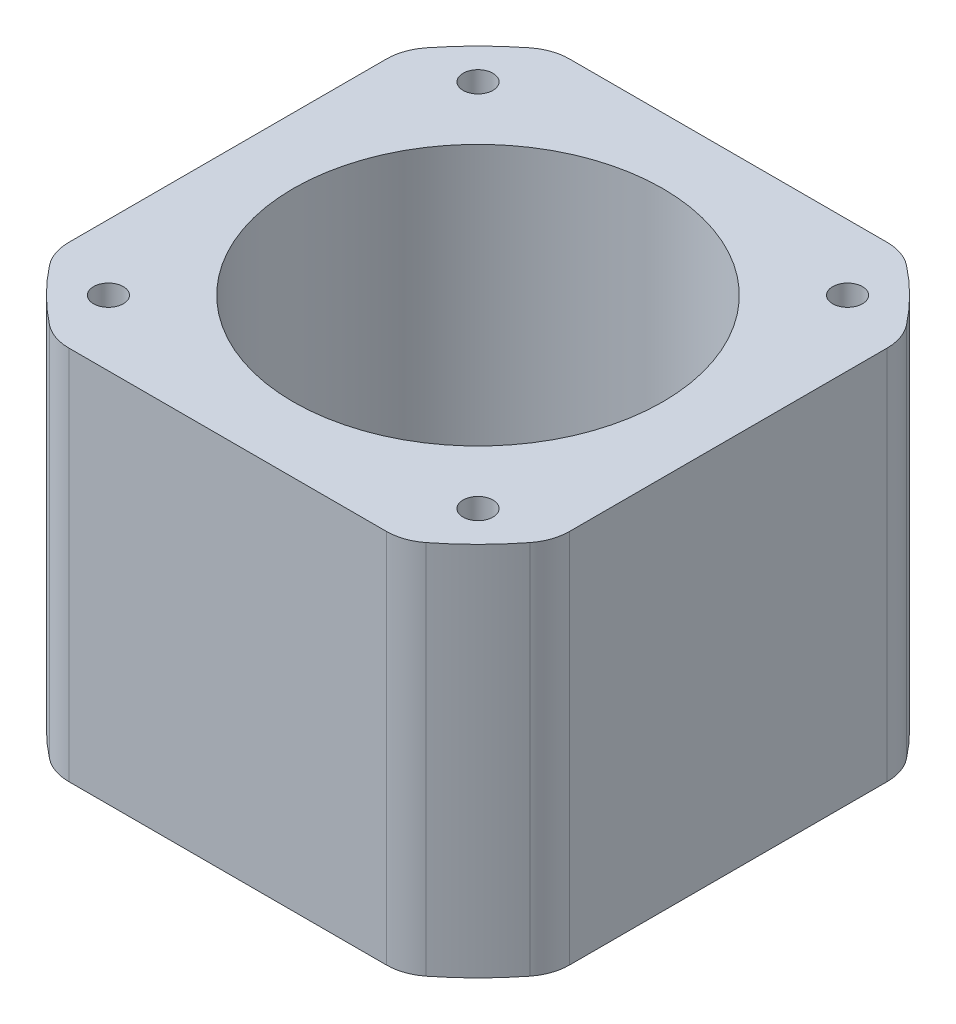
ISO-10303-21;
HEADER;
FILE_DESCRIPTION(('STEP AP214'),'2;1');
FILE_NAME('part.step','',(''),(''),'','','');
FILE_SCHEMA(('AUTOMOTIVE_DESIGN { 1 0 10303 214 1 1 1 1 }'));
ENDSEC;
DATA;
#1=APPLICATION_CONTEXT('core data for automotive mechanical design processes');
#2=APPLICATION_PROTOCOL_DEFINITION('international standard','automotive_design',2000,#1);
#3=PRODUCT_CONTEXT('',#1,'mechanical');
#4=PRODUCT('Part','Part','',(#3));
#5=PRODUCT_RELATED_PRODUCT_CATEGORY('part','',(#4));
#6=PRODUCT_DEFINITION_FORMATION('','',#4);
#7=PRODUCT_DEFINITION_CONTEXT('part definition',#1,'design');
#8=PRODUCT_DEFINITION('design','',#6,#7);
#9=PRODUCT_DEFINITION_SHAPE('','',#8);
#10=(LENGTH_UNIT() NAMED_UNIT(*) SI_UNIT(.MILLI.,.METRE.));
#11=(NAMED_UNIT(*) PLANE_ANGLE_UNIT() SI_UNIT($,.RADIAN.));
#12=(NAMED_UNIT(*) SI_UNIT($,.STERADIAN.) SOLID_ANGLE_UNIT());
#13=UNCERTAINTY_MEASURE_WITH_UNIT(LENGTH_MEASURE(1.E-05),#10,'distance_accuracy_value','');
#14=(GEOMETRIC_REPRESENTATION_CONTEXT(3) GLOBAL_UNCERTAINTY_ASSIGNED_CONTEXT((#13)) GLOBAL_UNIT_ASSIGNED_CONTEXT((#10,
#11,#12)) REPRESENTATION_CONTEXT('',''));
#15=CARTESIAN_POINT('',(0.,0.,0.));
#16=DIRECTION('',(0.,0.,1.));
#17=DIRECTION('',(1.,0.,0.));
#18=AXIS2_PLACEMENT_3D('',#15,#16,#17);
#19=CARTESIAN_POINT('',(15.5,31.5,15.5));
#20=DIRECTION('',(0.,-1.,0.));
#21=DIRECTION('',(0.,0.,-1.));
#22=AXIS2_PLACEMENT_3D('',#19,#20,#21);
#23=CYLINDRICAL_SURFACE('',#22,1.25000000000001);
#24=CARTESIAN_POINT('',(15.5,31.5,15.5));
#25=DIRECTION('',(0.,-1.,0.));
#26=DIRECTION('',(0.,0.,-1.));
#27=AXIS2_PLACEMENT_3D('',#24,#25,#26);
#28=CIRCLE('',#27,1.25000000000001);
#29=CARTESIAN_POINT('',(15.5,31.5,14.25));
#30=VERTEX_POINT('',#29);
#31=EDGE_CURVE('E197',#30,#30,#28,.T.);
#32=ORIENTED_EDGE('',*,*,#31,.F.);
#33=EDGE_LOOP('',(#32));
#34=FACE_BOUND('',#33,.T.);
#35=CARTESIAN_POINT('',(15.5,0.,15.5));
#36=DIRECTION('',(0.,-1.,0.));
#37=DIRECTION('',(0.,0.,-1.));
#38=AXIS2_PLACEMENT_3D('',#35,#36,#37);
#39=CIRCLE('',#38,1.25000000000001);
#40=CARTESIAN_POINT('',(15.5,0.,14.25));
#41=VERTEX_POINT('',#40);
#42=EDGE_CURVE('E19',#41,#41,#39,.T.);
#43=ORIENTED_EDGE('',*,*,#42,.T.);
#44=EDGE_LOOP('',(#43));
#45=FACE_BOUND('',#44,.T.);
#46=ADVANCED_FACE('F16',(#34,#45),#23,.F.);
#47=CARTESIAN_POINT('',(-15.5,31.5,-15.5));
#48=DIRECTION('',(0.,-1.,0.));
#49=DIRECTION('',(0.,0.,-1.));
#50=AXIS2_PLACEMENT_3D('',#47,#48,#49);
#51=CYLINDRICAL_SURFACE('',#50,1.25000000000001);
#52=CARTESIAN_POINT('',(-15.5,31.5,-15.5));
#53=DIRECTION('',(0.,-1.,0.));
#54=DIRECTION('',(0.,0.,-1.));
#55=AXIS2_PLACEMENT_3D('',#52,#53,#54);
#56=CIRCLE('',#55,1.25000000000001);
#57=CARTESIAN_POINT('',(-15.5,31.5,-16.75));
#58=VERTEX_POINT('',#57);
#59=EDGE_CURVE('E200',#58,#58,#56,.T.);
#60=ORIENTED_EDGE('',*,*,#59,.F.);
#61=EDGE_LOOP('',(#60));
#62=FACE_BOUND('',#61,.T.);
#63=CARTESIAN_POINT('',(-15.5,0.,-15.5));
#64=DIRECTION('',(0.,-1.,0.));
#65=DIRECTION('',(0.,0.,-1.));
#66=AXIS2_PLACEMENT_3D('',#63,#64,#65);
#67=CIRCLE('',#66,1.25000000000001);
#68=CARTESIAN_POINT('',(-15.5,0.,-16.75));
#69=VERTEX_POINT('',#68);
#70=EDGE_CURVE('E155',#69,#69,#67,.T.);
#71=ORIENTED_EDGE('',*,*,#70,.T.);
#72=EDGE_LOOP('',(#71));
#73=FACE_BOUND('',#72,.T.);
#74=ADVANCED_FACE('F519',(#62,#73),#51,.F.);
#75=CARTESIAN_POINT('',(0.,31.5,0.));
#76=DIRECTION('',(0.,-1.,0.));
#77=DIRECTION('',(0.,0.,-1.));
#78=AXIS2_PLACEMENT_3D('',#75,#76,#77);
#79=CYLINDRICAL_SURFACE('',#78,25.6);
#80=CARTESIAN_POINT('',(0.,31.5,0.));
#81=DIRECTION('',(0.,-1.,0.));
#82=DIRECTION('',(0.,0.,-1.));
#83=AXIS2_PLACEMENT_3D('',#80,#81,#82);
#84=CIRCLE('',#83,25.6);
#85=CARTESIAN_POINT('',(-15.7927871574424,31.5,-20.1481481481482));
#86=VERTEX_POINT('',#85);
#87=CARTESIAN_POINT('',(-20.1481481481482,31.5,-15.7927871574423));
#88=VERTEX_POINT('',#87);
#89=EDGE_CURVE('E203',#86,#88,#84,.F.);
#90=ORIENTED_EDGE('',*,*,#89,.F.);
#91=DIRECTION('',(0.,-1.,0.));
#92=VECTOR('',#91,1.);
#93=CARTESIAN_POINT('',(-15.7927871574424,31.5,-20.1481481481482));
#94=LINE('',#93,#92);
#95=CARTESIAN_POINT('',(-15.7927871574424,0.,-20.1481481481482));
#96=VERTEX_POINT('',#95);
#97=EDGE_CURVE('E267',#96,#86,#94,.F.);
#98=ORIENTED_EDGE('',*,*,#97,.F.);
#99=CARTESIAN_POINT('',(0.,0.,0.));
#100=DIRECTION('',(0.,-1.,0.));
#101=DIRECTION('',(0.,0.,-1.));
#102=AXIS2_PLACEMENT_3D('',#99,#100,#101);
#103=CIRCLE('',#102,25.6);
#104=CARTESIAN_POINT('',(-20.1481481481482,0.,-15.7927871574423));
#105=VERTEX_POINT('',#104);
#106=EDGE_CURVE('E184',#96,#105,#103,.F.);
#107=ORIENTED_EDGE('',*,*,#106,.T.);
#108=DIRECTION('',(0.,-1.,0.));
#109=VECTOR('',#108,1.);
#110=CARTESIAN_POINT('',(-20.1481481481482,31.5,-15.7927871574423));
#111=LINE('',#110,#109);
#112=EDGE_CURVE('E237',#88,#105,#111,.T.);
#113=ORIENTED_EDGE('',*,*,#112,.F.);
#114=EDGE_LOOP('',(#90,#98,#107,#113));
#115=FACE_BOUND('',#114,.T.);
#116=ADVANCED_FACE('F311',(#115),#79,.T.);
#117=CARTESIAN_POINT('',(-17.,31.5,-13.325164164092));
#118=DIRECTION('',(0.,-1.,0.));
#119=DIRECTION('',(0.,0.,-1.));
#120=AXIS2_PLACEMENT_3D('',#117,#118,#119);
#121=CYLINDRICAL_SURFACE('',#120,4.);
#122=CARTESIAN_POINT('',(-17.,0.,-13.325164164092));
#123=DIRECTION('',(0.,-1.,0.));
#124=DIRECTION('',(0.,0.,-1.));
#125=AXIS2_PLACEMENT_3D('',#122,#123,#124);
#126=CIRCLE('',#125,4.);
#127=CARTESIAN_POINT('',(-21.,0.,-13.325164164092));
#128=VERTEX_POINT('',#127);
#129=EDGE_CURVE('E187',#105,#128,#126,.F.);
#130=ORIENTED_EDGE('',*,*,#129,.T.);
#131=DIRECTION('',(0.,1.,0.));
#132=VECTOR('',#131,1.);
#133=CARTESIAN_POINT('',(-21.,31.5,-13.325164164092));
#134=LINE('',#133,#132);
#135=CARTESIAN_POINT('',(-21.,31.5,-13.325164164092));
#136=VERTEX_POINT('',#135);
#137=EDGE_CURVE('E239',#128,#136,#134,.T.);
#138=ORIENTED_EDGE('',*,*,#137,.T.);
#139=CARTESIAN_POINT('',(-17.,31.5,-13.325164164092));
#140=DIRECTION('',(0.,-1.,0.));
#141=DIRECTION('',(0.,0.,-1.));
#142=AXIS2_PLACEMENT_3D('',#139,#140,#141);
#143=CIRCLE('',#142,4.);
#144=EDGE_CURVE('E205',#88,#136,#143,.F.);
#145=ORIENTED_EDGE('',*,*,#144,.F.);
#146=ORIENTED_EDGE('',*,*,#112,.T.);
#147=EDGE_LOOP('',(#130,#138,#145,#146));
#148=FACE_BOUND('',#147,.T.);
#149=ADVANCED_FACE('F315',(#148),#121,.T.);
#150=CARTESIAN_POINT('',(-21.,31.5,14.641038214553));
#151=DIRECTION('',(1.,0.,0.));
#152=DIRECTION('',(0.,0.,-1.));
#153=AXIS2_PLACEMENT_3D('',#150,#151,#152);
#154=PLANE('',#153);
#155=ORIENTED_EDGE('',*,*,#137,.F.);
#156=DIRECTION('',(0.,0.,1.));
#157=VECTOR('',#156,1.);
#158=CARTESIAN_POINT('',(-21.,0.,0.));
#159=LINE('',#158,#157);
#160=CARTESIAN_POINT('',(-21.,0.,13.325164164092));
#161=VERTEX_POINT('',#160);
#162=EDGE_CURVE('E190',#128,#161,#159,.T.);
#163=ORIENTED_EDGE('',*,*,#162,.T.);
#164=DIRECTION('',(0.,-1.,0.));
#165=VECTOR('',#164,1.);
#166=CARTESIAN_POINT('',(-21.,31.5,13.325164164092));
#167=LINE('',#166,#165);
#168=CARTESIAN_POINT('',(-21.,31.5,13.325164164092));
#169=VERTEX_POINT('',#168);
#170=EDGE_CURVE('E127',#169,#161,#167,.T.);
#171=ORIENTED_EDGE('',*,*,#170,.F.);
#172=DIRECTION('',(0.,0.,1.));
#173=VECTOR('',#172,1.);
#174=CARTESIAN_POINT('',(-21.,31.5,0.));
#175=LINE('',#174,#173);
#176=EDGE_CURVE('E207',#136,#169,#175,.T.);
#177=ORIENTED_EDGE('',*,*,#176,.F.);
#178=EDGE_LOOP('',(#155,#163,#171,#177));
#179=FACE_BOUND('',#178,.T.);
#180=ADVANCED_FACE('F318',(#179),#154,.F.);
#181=CARTESIAN_POINT('',(-17.,31.5,13.325164164092));
#182=DIRECTION('',(0.,-1.,0.));
#183=DIRECTION('',(0.,0.,-1.));
#184=AXIS2_PLACEMENT_3D('',#181,#182,#183);
#185=CYLINDRICAL_SURFACE('',#184,4.);
#186=CARTESIAN_POINT('',(-17.,0.,13.325164164092));
#187=DIRECTION('',(0.,-1.,0.));
#188=DIRECTION('',(0.,0.,-1.));
#189=AXIS2_PLACEMENT_3D('',#186,#187,#188);
#190=CIRCLE('',#189,4.);
#191=CARTESIAN_POINT('',(-20.1481481481482,0.,15.7927871574423));
#192=VERTEX_POINT('',#191);
#193=EDGE_CURVE('E148',#161,#192,#190,.F.);
#194=ORIENTED_EDGE('',*,*,#193,.T.);
#195=DIRECTION('',(0.,-1.,0.));
#196=VECTOR('',#195,1.);
#197=CARTESIAN_POINT('',(-20.1481481481482,31.5,15.7927871574423));
#198=LINE('',#197,#196);
#199=CARTESIAN_POINT('',(-20.1481481481482,31.5,15.7927871574423));
#200=VERTEX_POINT('',#199);
#201=EDGE_CURVE('E134',#200,#192,#198,.T.);
#202=ORIENTED_EDGE('',*,*,#201,.F.);
#203=CARTESIAN_POINT('',(-17.,31.5,13.325164164092));
#204=DIRECTION('',(0.,-1.,0.));
#205=DIRECTION('',(0.,0.,-1.));
#206=AXIS2_PLACEMENT_3D('',#203,#204,#205);
#207=CIRCLE('',#206,4.);
#208=EDGE_CURVE('E208',#169,#200,#207,.F.);
#209=ORIENTED_EDGE('',*,*,#208,.F.);
#210=ORIENTED_EDGE('',*,*,#170,.T.);
#211=EDGE_LOOP('',(#194,#202,#209,#210));
#212=FACE_BOUND('',#211,.T.);
#213=ADVANCED_FACE('F154',(#212),#185,.T.);
#214=CARTESIAN_POINT('',(0.,31.5,0.));
#215=DIRECTION('',(0.,-1.,0.));
#216=DIRECTION('',(0.,0.,-1.));
#217=AXIS2_PLACEMENT_3D('',#214,#215,#216);
#218=CYLINDRICAL_SURFACE('',#217,25.6);
#219=CARTESIAN_POINT('',(0.,31.5,0.));
#220=DIRECTION('',(0.,-1.,0.));
#221=DIRECTION('',(0.,0.,-1.));
#222=AXIS2_PLACEMENT_3D('',#219,#220,#221);
#223=CIRCLE('',#222,25.6);
#224=CARTESIAN_POINT('',(-15.7927871574423,31.5,20.1481481481482));
#225=VERTEX_POINT('',#224);
#226=EDGE_CURVE('E139',#200,#225,#223,.F.);
#227=ORIENTED_EDGE('',*,*,#226,.F.);
#228=ORIENTED_EDGE('',*,*,#201,.T.);
#229=CARTESIAN_POINT('',(0.,0.,0.));
#230=DIRECTION('',(0.,-1.,0.));
#231=DIRECTION('',(0.,0.,-1.));
#232=AXIS2_PLACEMENT_3D('',#229,#230,#231);
#233=CIRCLE('',#232,25.6);
#234=CARTESIAN_POINT('',(-15.7927871574423,0.,20.1481481481482));
#235=VERTEX_POINT('',#234);
#236=EDGE_CURVE('E138',#192,#235,#233,.F.);
#237=ORIENTED_EDGE('',*,*,#236,.T.);
#238=DIRECTION('',(0.,-1.,0.));
#239=VECTOR('',#238,1.);
#240=CARTESIAN_POINT('',(-15.7927871574423,31.5,20.1481481481482));
#241=LINE('',#240,#239);
#242=EDGE_CURVE('E140',#225,#235,#241,.T.);
#243=ORIENTED_EDGE('',*,*,#242,.F.);
#244=EDGE_LOOP('',(#227,#228,#237,#243));
#245=FACE_BOUND('',#244,.T.);
#246=ADVANCED_FACE('F136',(#245),#218,.T.);
#247=CARTESIAN_POINT('',(-13.325164164092,31.5,17.));
#248=DIRECTION('',(0.,-1.,0.));
#249=DIRECTION('',(0.,0.,-1.));
#250=AXIS2_PLACEMENT_3D('',#247,#248,#249);
#251=CYLINDRICAL_SURFACE('',#250,4.);
#252=CARTESIAN_POINT('',(-13.325164164092,0.,17.));
#253=DIRECTION('',(0.,-1.,0.));
#254=DIRECTION('',(0.,0.,-1.));
#255=AXIS2_PLACEMENT_3D('',#252,#253,#254);
#256=CIRCLE('',#255,4.);
#257=CARTESIAN_POINT('',(-13.325164164092,0.,21.));
#258=VERTEX_POINT('',#257);
#259=EDGE_CURVE('E152',#235,#258,#256,.F.);
#260=ORIENTED_EDGE('',*,*,#259,.T.);
#261=DIRECTION('',(0.,1.,0.));
#262=VECTOR('',#261,1.);
#263=CARTESIAN_POINT('',(-13.325164164092,31.5,21.));
#264=LINE('',#263,#262);
#265=CARTESIAN_POINT('',(-13.325164164092,31.5,21.));
#266=VERTEX_POINT('',#265);
#267=EDGE_CURVE('E244',#258,#266,#264,.T.);
#268=ORIENTED_EDGE('',*,*,#267,.T.);
#269=CARTESIAN_POINT('',(-13.325164164092,31.5,17.));
#270=DIRECTION('',(0.,-1.,0.));
#271=DIRECTION('',(0.,0.,-1.));
#272=AXIS2_PLACEMENT_3D('',#269,#270,#271);
#273=CIRCLE('',#272,4.);
#274=EDGE_CURVE('E211',#225,#266,#273,.F.);
#275=ORIENTED_EDGE('',*,*,#274,.F.);
#276=ORIENTED_EDGE('',*,*,#242,.T.);
#277=EDGE_LOOP('',(#260,#268,#275,#276));
#278=FACE_BOUND('',#277,.T.);
#279=ADVANCED_FACE('F337',(#278),#251,.T.);
#280=CARTESIAN_POINT('',(-14.641038214553,31.5,21.));
#281=DIRECTION('',(0.,0.,-1.));
#282=DIRECTION('',(-1.,0.,0.));
#283=AXIS2_PLACEMENT_3D('',#280,#281,#282);
#284=PLANE('',#283);
#285=DIRECTION('',(0.,-1.,0.));
#286=VECTOR('',#285,1.);
#287=CARTESIAN_POINT('',(13.3251641640919,31.5,21.));
#288=LINE('',#287,#286);
#289=CARTESIAN_POINT('',(13.3251641640919,31.5,21.));
#290=VERTEX_POINT('',#289);
#291=CARTESIAN_POINT('',(13.3251641640919,0.,21.));
#292=VERTEX_POINT('',#291);
#293=EDGE_CURVE('E247',#290,#292,#288,.T.);
#294=ORIENTED_EDGE('',*,*,#293,.F.);
#295=DIRECTION('',(1.,0.,0.));
#296=VECTOR('',#295,1.);
#297=CARTESIAN_POINT('',(0.,31.5,21.));
#298=LINE('',#297,#296);
#299=EDGE_CURVE('E213',#266,#290,#298,.T.);
#300=ORIENTED_EDGE('',*,*,#299,.F.);
#301=ORIENTED_EDGE('',*,*,#267,.F.);
#302=DIRECTION('',(1.,0.,0.));
#303=VECTOR('',#302,1.);
#304=CARTESIAN_POINT('',(0.,0.,21.));
#305=LINE('',#304,#303);
#306=EDGE_CURVE('E160',#258,#292,#305,.T.);
#307=ORIENTED_EDGE('',*,*,#306,.T.);
#308=EDGE_LOOP('',(#294,#300,#301,#307));
#309=FACE_BOUND('',#308,.T.);
#310=ADVANCED_FACE('F335',(#309),#284,.F.);
#311=CARTESIAN_POINT('',(13.3251641640919,31.5,17.));
#312=DIRECTION('',(0.,-1.,0.));
#313=DIRECTION('',(0.,0.,-1.));
#314=AXIS2_PLACEMENT_3D('',#311,#312,#313);
#315=CYLINDRICAL_SURFACE('',#314,4.);
#316=CARTESIAN_POINT('',(13.3251641640919,0.,17.));
#317=DIRECTION('',(0.,-1.,0.));
#318=DIRECTION('',(0.,0.,-1.));
#319=AXIS2_PLACEMENT_3D('',#316,#317,#318);
#320=CIRCLE('',#319,4.);
#321=CARTESIAN_POINT('',(15.7927871574423,0.,20.1481481481482));
#322=VERTEX_POINT('',#321);
#323=EDGE_CURVE('E161',#292,#322,#320,.F.);
#324=ORIENTED_EDGE('',*,*,#323,.T.);
#325=DIRECTION('',(0.,-1.,0.));
#326=VECTOR('',#325,1.);
#327=CARTESIAN_POINT('',(15.7927871574423,31.5,20.1481481481482));
#328=LINE('',#327,#326);
#329=CARTESIAN_POINT('',(15.7927871574423,31.5,20.1481481481482));
#330=VERTEX_POINT('',#329);
#331=EDGE_CURVE('E249',#330,#322,#328,.T.);
#332=ORIENTED_EDGE('',*,*,#331,.F.);
#333=CARTESIAN_POINT('',(13.3251641640919,31.5,17.));
#334=DIRECTION('',(0.,-1.,0.));
#335=DIRECTION('',(0.,0.,-1.));
#336=AXIS2_PLACEMENT_3D('',#333,#334,#335);
#337=CIRCLE('',#336,4.);
#338=EDGE_CURVE('E214',#290,#330,#337,.F.);
#339=ORIENTED_EDGE('',*,*,#338,.F.);
#340=ORIENTED_EDGE('',*,*,#293,.T.);
#341=EDGE_LOOP('',(#324,#332,#339,#340));
#342=FACE_BOUND('',#341,.T.);
#343=ADVANCED_FACE('F330',(#342),#315,.T.);
#344=CARTESIAN_POINT('',(0.,31.5,0.));
#345=DIRECTION('',(0.,-1.,0.));
#346=DIRECTION('',(0.,0.,-1.));
#347=AXIS2_PLACEMENT_3D('',#344,#345,#346);
#348=CYLINDRICAL_SURFACE('',#347,25.6);
#349=CARTESIAN_POINT('',(0.,31.5,0.));
#350=DIRECTION('',(0.,-1.,0.));
#351=DIRECTION('',(0.,0.,-1.));
#352=AXIS2_PLACEMENT_3D('',#349,#350,#351);
#353=CIRCLE('',#352,25.6);
#354=CARTESIAN_POINT('',(20.1481481481481,31.5,15.7927871574423));
#355=VERTEX_POINT('',#354);
#356=EDGE_CURVE('E216',#330,#355,#353,.F.);
#357=ORIENTED_EDGE('',*,*,#356,.F.);
#358=ORIENTED_EDGE('',*,*,#331,.T.);
#359=CARTESIAN_POINT('',(0.,0.,0.));
#360=DIRECTION('',(0.,-1.,0.));
#361=DIRECTION('',(0.,0.,-1.));
#362=AXIS2_PLACEMENT_3D('',#359,#360,#361);
#363=CIRCLE('',#362,25.6);
#364=CARTESIAN_POINT('',(20.1481481481481,0.,15.7927871574423));
#365=VERTEX_POINT('',#364);
#366=EDGE_CURVE('E164',#322,#365,#363,.F.);
#367=ORIENTED_EDGE('',*,*,#366,.T.);
#368=DIRECTION('',(0.,-1.,0.));
#369=VECTOR('',#368,1.);
#370=CARTESIAN_POINT('',(20.1481481481481,31.5,15.7927871574423));
#371=LINE('',#370,#369);
#372=EDGE_CURVE('E251',#355,#365,#371,.T.);
#373=ORIENTED_EDGE('',*,*,#372,.F.);
#374=EDGE_LOOP('',(#357,#358,#367,#373));
#375=FACE_BOUND('',#374,.T.);
#376=ADVANCED_FACE('F326',(#375),#348,.T.);
#377=CARTESIAN_POINT('',(17.,31.5,13.3251641640919));
#378=DIRECTION('',(0.,-1.,0.));
#379=DIRECTION('',(0.,0.,-1.));
#380=AXIS2_PLACEMENT_3D('',#377,#378,#379);
#381=CYLINDRICAL_SURFACE('',#380,4.);
#382=CARTESIAN_POINT('',(17.,0.,13.3251641640919));
#383=DIRECTION('',(0.,-1.,0.));
#384=DIRECTION('',(0.,0.,-1.));
#385=AXIS2_PLACEMENT_3D('',#382,#383,#384);
#386=CIRCLE('',#385,4.);
#387=CARTESIAN_POINT('',(21.,0.,13.3251641640919));
#388=VERTEX_POINT('',#387);
#389=EDGE_CURVE('E167',#365,#388,#386,.F.);
#390=ORIENTED_EDGE('',*,*,#389,.T.);
#391=DIRECTION('',(0.,1.,0.));
#392=VECTOR('',#391,1.);
#393=CARTESIAN_POINT('',(21.,31.5,13.3251641640919));
#394=LINE('',#393,#392);
#395=CARTESIAN_POINT('',(21.,31.5,13.3251641640919));
#396=VERTEX_POINT('',#395);
#397=EDGE_CURVE('E253',#388,#396,#394,.T.);
#398=ORIENTED_EDGE('',*,*,#397,.T.);
#399=CARTESIAN_POINT('',(17.,31.5,13.3251641640919));
#400=DIRECTION('',(0.,-1.,0.));
#401=DIRECTION('',(0.,0.,-1.));
#402=AXIS2_PLACEMENT_3D('',#399,#400,#401);
#403=CIRCLE('',#402,4.);
#404=EDGE_CURVE('E218',#355,#396,#403,.F.);
#405=ORIENTED_EDGE('',*,*,#404,.F.);
#406=ORIENTED_EDGE('',*,*,#372,.T.);
#407=EDGE_LOOP('',(#390,#398,#405,#406));
#408=FACE_BOUND('',#407,.T.);
#409=ADVANCED_FACE('F322',(#408),#381,.T.);
#410=CARTESIAN_POINT('',(21.,31.5,14.641038214553));
#411=DIRECTION('',(-1.,0.,0.));
#412=DIRECTION('',(0.,0.,1.));
#413=AXIS2_PLACEMENT_3D('',#410,#411,#412);
#414=PLANE('',#413);
#415=DIRECTION('',(0.,-1.,0.));
#416=VECTOR('',#415,1.);
#417=CARTESIAN_POINT('',(21.,31.5,-13.3251641640919));
#418=LINE('',#417,#416);
#419=CARTESIAN_POINT('',(21.,31.5,-13.3251641640919));
#420=VERTEX_POINT('',#419);
#421=CARTESIAN_POINT('',(21.,0.,-13.3251641640919));
#422=VERTEX_POINT('',#421);
#423=EDGE_CURVE('E256',#420,#422,#418,.T.);
#424=ORIENTED_EDGE('',*,*,#423,.F.);
#425=DIRECTION('',(0.,0.,1.));
#426=VECTOR('',#425,1.);
#427=CARTESIAN_POINT('',(21.,31.5,0.));
#428=LINE('',#427,#426);
#429=EDGE_CURVE('E220',#396,#420,#428,.F.);
#430=ORIENTED_EDGE('',*,*,#429,.F.);
#431=ORIENTED_EDGE('',*,*,#397,.F.);
#432=DIRECTION('',(0.,0.,1.));
#433=VECTOR('',#432,1.);
#434=CARTESIAN_POINT('',(21.,0.,0.));
#435=LINE('',#434,#433);
#436=EDGE_CURVE('E170',#388,#422,#435,.F.);
#437=ORIENTED_EDGE('',*,*,#436,.T.);
#438=EDGE_LOOP('',(#424,#430,#431,#437));
#439=FACE_BOUND('',#438,.T.);
#440=ADVANCED_FACE('F287',(#439),#414,.F.);
#441=CARTESIAN_POINT('',(17.,31.5,-13.3251641640919));
#442=DIRECTION('',(0.,-1.,0.));
#443=DIRECTION('',(0.,0.,-1.));
#444=AXIS2_PLACEMENT_3D('',#441,#442,#443);
#445=CYLINDRICAL_SURFACE('',#444,4.);
#446=CARTESIAN_POINT('',(17.,0.,-13.3251641640919));
#447=DIRECTION('',(0.,-1.,0.));
#448=DIRECTION('',(0.,0.,-1.));
#449=AXIS2_PLACEMENT_3D('',#446,#447,#448);
#450=CIRCLE('',#449,4.);
#451=CARTESIAN_POINT('',(20.1481481481481,0.,-15.7927871574423));
#452=VERTEX_POINT('',#451);
#453=EDGE_CURVE('E171',#422,#452,#450,.F.);
#454=ORIENTED_EDGE('',*,*,#453,.T.);
#455=DIRECTION('',(0.,-1.,0.));
#456=VECTOR('',#455,1.);
#457=CARTESIAN_POINT('',(20.1481481481481,31.5,-15.7927871574423));
#458=LINE('',#457,#456);
#459=CARTESIAN_POINT('',(20.1481481481481,31.5,-15.7927871574423));
#460=VERTEX_POINT('',#459);
#461=EDGE_CURVE('E258',#460,#452,#458,.T.);
#462=ORIENTED_EDGE('',*,*,#461,.F.);
#463=CARTESIAN_POINT('',(17.,31.5,-13.3251641640919));
#464=DIRECTION('',(0.,-1.,0.));
#465=DIRECTION('',(0.,0.,-1.));
#466=AXIS2_PLACEMENT_3D('',#463,#464,#465);
#467=CIRCLE('',#466,4.);
#468=EDGE_CURVE('E221',#420,#460,#467,.F.);
#469=ORIENTED_EDGE('',*,*,#468,.F.);
#470=ORIENTED_EDGE('',*,*,#423,.T.);
#471=EDGE_LOOP('',(#454,#462,#469,#470));
#472=FACE_BOUND('',#471,.T.);
#473=ADVANCED_FACE('F291',(#472),#445,.T.);
#474=CARTESIAN_POINT('',(0.,31.5,0.));
#475=DIRECTION('',(0.,-1.,0.));
#476=DIRECTION('',(0.,0.,-1.));
#477=AXIS2_PLACEMENT_3D('',#474,#475,#476);
#478=CYLINDRICAL_SURFACE('',#477,25.6);
#479=CARTESIAN_POINT('',(0.,31.5,0.));
#480=DIRECTION('',(0.,-1.,0.));
#481=DIRECTION('',(0.,0.,-1.));
#482=AXIS2_PLACEMENT_3D('',#479,#480,#481);
#483=CIRCLE('',#482,25.6);
#484=CARTESIAN_POINT('',(15.7927871574423,31.5,-20.1481481481482));
#485=VERTEX_POINT('',#484);
#486=EDGE_CURVE('E223',#460,#485,#483,.F.);
#487=ORIENTED_EDGE('',*,*,#486,.F.);
#488=ORIENTED_EDGE('',*,*,#461,.T.);
#489=CARTESIAN_POINT('',(0.,0.,0.));
#490=DIRECTION('',(0.,-1.,0.));
#491=DIRECTION('',(0.,0.,-1.));
#492=AXIS2_PLACEMENT_3D('',#489,#490,#491);
#493=CIRCLE('',#492,25.6);
#494=CARTESIAN_POINT('',(15.7927871574423,0.,-20.1481481481482));
#495=VERTEX_POINT('',#494);
#496=EDGE_CURVE('E174',#452,#495,#493,.F.);
#497=ORIENTED_EDGE('',*,*,#496,.T.);
#498=DIRECTION('',(0.,-1.,0.));
#499=VECTOR('',#498,1.);
#500=CARTESIAN_POINT('',(15.7927871574423,31.5,-20.1481481481482));
#501=LINE('',#500,#499);
#502=EDGE_CURVE('E260',#485,#495,#501,.T.);
#503=ORIENTED_EDGE('',*,*,#502,.F.);
#504=EDGE_LOOP('',(#487,#488,#497,#503));
#505=FACE_BOUND('',#504,.T.);
#506=ADVANCED_FACE('F296',(#505),#478,.T.);
#507=CARTESIAN_POINT('',(13.3251641640919,31.5,-17.));
#508=DIRECTION('',(0.,-1.,0.));
#509=DIRECTION('',(0.,0.,-1.));
#510=AXIS2_PLACEMENT_3D('',#507,#508,#509);
#511=CYLINDRICAL_SURFACE('',#510,4.);
#512=CARTESIAN_POINT('',(13.3251641640919,0.,-17.));
#513=DIRECTION('',(0.,-1.,0.));
#514=DIRECTION('',(0.,0.,-1.));
#515=AXIS2_PLACEMENT_3D('',#512,#513,#514);
#516=CIRCLE('',#515,4.);
#517=CARTESIAN_POINT('',(13.3251641640919,0.,-21.));
#518=VERTEX_POINT('',#517);
#519=EDGE_CURVE('E177',#495,#518,#516,.F.);
#520=ORIENTED_EDGE('',*,*,#519,.T.);
#521=DIRECTION('',(0.,1.,0.));
#522=VECTOR('',#521,1.);
#523=CARTESIAN_POINT('',(13.3251641640919,31.5,-21.));
#524=LINE('',#523,#522);
#525=CARTESIAN_POINT('',(13.3251641640919,31.5,-21.));
#526=VERTEX_POINT('',#525);
#527=EDGE_CURVE('E262',#518,#526,#524,.T.);
#528=ORIENTED_EDGE('',*,*,#527,.T.);
#529=CARTESIAN_POINT('',(13.3251641640919,31.5,-17.));
#530=DIRECTION('',(0.,-1.,0.));
#531=DIRECTION('',(0.,0.,-1.));
#532=AXIS2_PLACEMENT_3D('',#529,#530,#531);
#533=CIRCLE('',#532,4.);
#534=EDGE_CURVE('E225',#485,#526,#533,.F.);
#535=ORIENTED_EDGE('',*,*,#534,.F.);
#536=ORIENTED_EDGE('',*,*,#502,.T.);
#537=EDGE_LOOP('',(#520,#528,#535,#536));
#538=FACE_BOUND('',#537,.T.);
#539=ADVANCED_FACE('F299',(#538),#511,.T.);
#540=CARTESIAN_POINT('',(-14.641038214553,31.5,-21.));
#541=DIRECTION('',(0.,0.,1.));
#542=DIRECTION('',(1.,0.,0.));
#543=AXIS2_PLACEMENT_3D('',#540,#541,#542);
#544=PLANE('',#543);
#545=DIRECTION('',(0.,-1.,0.));
#546=VECTOR('',#545,1.);
#547=CARTESIAN_POINT('',(-13.325164164092,31.5,-21.));
#548=LINE('',#547,#546);
#549=CARTESIAN_POINT('',(-13.325164164092,31.5,-21.));
#550=VERTEX_POINT('',#549);
#551=CARTESIAN_POINT('',(-13.325164164092,0.,-21.));
#552=VERTEX_POINT('',#551);
#553=EDGE_CURVE('E265',#550,#552,#548,.T.);
#554=ORIENTED_EDGE('',*,*,#553,.F.);
#555=DIRECTION('',(1.,0.,0.));
#556=VECTOR('',#555,1.);
#557=CARTESIAN_POINT('',(0.,31.5,-21.));
#558=LINE('',#557,#556);
#559=EDGE_CURVE('E34',#526,#550,#558,.F.);
#560=ORIENTED_EDGE('',*,*,#559,.F.);
#561=ORIENTED_EDGE('',*,*,#527,.F.);
#562=DIRECTION('',(1.,0.,0.));
#563=VECTOR('',#562,1.);
#564=CARTESIAN_POINT('',(0.,0.,-21.));
#565=LINE('',#564,#563);
#566=EDGE_CURVE('E180',#518,#552,#565,.F.);
#567=ORIENTED_EDGE('',*,*,#566,.T.);
#568=EDGE_LOOP('',(#554,#560,#561,#567));
#569=FACE_BOUND('',#568,.T.);
#570=ADVANCED_FACE('F303',(#569),#544,.F.);
#571=CARTESIAN_POINT('',(-13.325164164092,31.5,-17.));
#572=DIRECTION('',(0.,-1.,0.));
#573=DIRECTION('',(0.,0.,-1.));
#574=AXIS2_PLACEMENT_3D('',#571,#572,#573);
#575=CYLINDRICAL_SURFACE('',#574,4.);
#576=CARTESIAN_POINT('',(-13.325164164092,0.,-17.));
#577=DIRECTION('',(0.,-1.,0.));
#578=DIRECTION('',(0.,0.,-1.));
#579=AXIS2_PLACEMENT_3D('',#576,#577,#578);
#580=CIRCLE('',#579,4.);
#581=EDGE_CURVE('E181',#552,#96,#580,.F.);
#582=ORIENTED_EDGE('',*,*,#581,.T.);
#583=ORIENTED_EDGE('',*,*,#97,.T.);
#584=CARTESIAN_POINT('',(-13.325164164092,31.5,-17.));
#585=DIRECTION('',(0.,-1.,0.));
#586=DIRECTION('',(0.,0.,-1.));
#587=AXIS2_PLACEMENT_3D('',#584,#585,#586);
#588=CIRCLE('',#587,4.);
#589=EDGE_CURVE('E227',#550,#86,#588,.F.);
#590=ORIENTED_EDGE('',*,*,#589,.F.);
#591=ORIENTED_EDGE('',*,*,#553,.T.);
#592=EDGE_LOOP('',(#582,#583,#590,#591));
#593=FACE_BOUND('',#592,.T.);
#594=ADVANCED_FACE('F307',(#593),#575,.T.);
#595=CARTESIAN_POINT('',(15.5,31.5,-15.5));
#596=DIRECTION('',(0.,-1.,0.));
#597=DIRECTION('',(0.,0.,-1.));
#598=AXIS2_PLACEMENT_3D('',#595,#596,#597);
#599=CYLINDRICAL_SURFACE('',#598,1.25000000000001);
#600=CARTESIAN_POINT('',(15.5,31.5,-15.5));
#601=DIRECTION('',(0.,-1.,0.));
#602=DIRECTION('',(0.,0.,-1.));
#603=AXIS2_PLACEMENT_3D('',#600,#601,#602);
#604=CIRCLE('',#603,1.25000000000001);
#605=CARTESIAN_POINT('',(15.5,31.5,-16.75));
#606=VERTEX_POINT('',#605);
#607=EDGE_CURVE('E229',#606,#606,#604,.T.);
#608=ORIENTED_EDGE('',*,*,#607,.F.);
#609=EDGE_LOOP('',(#608));
#610=FACE_BOUND('',#609,.T.);
#611=CARTESIAN_POINT('',(15.5,0.,-15.5));
#612=DIRECTION('',(0.,-1.,0.));
#613=DIRECTION('',(0.,0.,-1.));
#614=AXIS2_PLACEMENT_3D('',#611,#612,#613);
#615=CIRCLE('',#614,1.25000000000001);
#616=CARTESIAN_POINT('',(15.5,0.,-16.75));
#617=VERTEX_POINT('',#616);
#618=EDGE_CURVE('E191',#617,#617,#615,.T.);
#619=ORIENTED_EDGE('',*,*,#618,.T.);
#620=EDGE_LOOP('',(#619));
#621=FACE_BOUND('',#620,.T.);
#622=ADVANCED_FACE('F366',(#610,#621),#599,.F.);
#623=CARTESIAN_POINT('',(-15.5,31.5,15.5));
#624=DIRECTION('',(0.,-1.,0.));
#625=DIRECTION('',(0.,0.,-1.));
#626=AXIS2_PLACEMENT_3D('',#623,#624,#625);
#627=CYLINDRICAL_SURFACE('',#626,1.25000000000001);
#628=CARTESIAN_POINT('',(-15.5,31.5,15.5));
#629=DIRECTION('',(0.,-1.,0.));
#630=DIRECTION('',(0.,0.,-1.));
#631=AXIS2_PLACEMENT_3D('',#628,#629,#630);
#632=CIRCLE('',#631,1.25000000000001);
#633=CARTESIAN_POINT('',(-15.5,31.5,14.25));
#634=VERTEX_POINT('',#633);
#635=EDGE_CURVE('E232',#634,#634,#632,.T.);
#636=ORIENTED_EDGE('',*,*,#635,.F.);
#637=EDGE_LOOP('',(#636));
#638=FACE_BOUND('',#637,.T.);
#639=CARTESIAN_POINT('',(-15.5,0.,15.5));
#640=DIRECTION('',(0.,-1.,0.));
#641=DIRECTION('',(0.,0.,-1.));
#642=AXIS2_PLACEMENT_3D('',#639,#640,#641);
#643=CIRCLE('',#642,1.25000000000001);
#644=CARTESIAN_POINT('',(-15.5,0.,14.25));
#645=VERTEX_POINT('',#644);
#646=EDGE_CURVE('E194',#645,#645,#643,.T.);
#647=ORIENTED_EDGE('',*,*,#646,.T.);
#648=EDGE_LOOP('',(#647));
#649=FACE_BOUND('',#648,.T.);
#650=ADVANCED_FACE('F362',(#638,#649),#627,.F.);
#651=CARTESIAN_POINT('',(0.,0.,0.));
#652=DIRECTION('',(0.,1.,0.));
#653=DIRECTION('',(0.,0.,1.));
#654=AXIS2_PLACEMENT_3D('',#651,#652,#653);
#655=PLANE('',#654);
#656=ORIENTED_EDGE('',*,*,#646,.F.);
#657=EDGE_LOOP('',(#656));
#658=FACE_BOUND('',#657,.T.);
#659=ORIENTED_EDGE('',*,*,#618,.F.);
#660=EDGE_LOOP('',(#659));
#661=FACE_BOUND('',#660,.T.);
#662=CARTESIAN_POINT('',(0.,0.,0.));
#663=DIRECTION('',(0.,-1.,0.));
#664=DIRECTION('',(0.,0.,-1.));
#665=AXIS2_PLACEMENT_3D('',#662,#663,#664);
#666=CIRCLE('',#665,15.5);
#667=CARTESIAN_POINT('',(0.,0.,-15.5));
#668=VERTEX_POINT('',#667);
#669=EDGE_CURVE('E25',#668,#668,#666,.F.);
#670=ORIENTED_EDGE('',*,*,#669,.T.);
#671=EDGE_LOOP('',(#670));
#672=FACE_BOUND('',#671,.T.);
#673=ORIENTED_EDGE('',*,*,#129,.F.);
#674=ORIENTED_EDGE('',*,*,#106,.F.);
#675=ORIENTED_EDGE('',*,*,#581,.F.);
#676=ORIENTED_EDGE('',*,*,#566,.F.);
#677=ORIENTED_EDGE('',*,*,#519,.F.);
#678=ORIENTED_EDGE('',*,*,#496,.F.);
#679=ORIENTED_EDGE('',*,*,#453,.F.);
#680=ORIENTED_EDGE('',*,*,#436,.F.);
#681=ORIENTED_EDGE('',*,*,#389,.F.);
#682=ORIENTED_EDGE('',*,*,#366,.F.);
#683=ORIENTED_EDGE('',*,*,#323,.F.);
#684=ORIENTED_EDGE('',*,*,#306,.F.);
#685=ORIENTED_EDGE('',*,*,#259,.F.);
#686=ORIENTED_EDGE('',*,*,#236,.F.);
#687=ORIENTED_EDGE('',*,*,#193,.F.);
#688=ORIENTED_EDGE('',*,*,#162,.F.);
#689=EDGE_LOOP('',(#673,#674,#675,#676,#677,#678,#679,#680,#681,#682,#683,#684,#685,#686,#687,#688));
#690=FACE_BOUND('',#689,.T.);
#691=ORIENTED_EDGE('',*,*,#70,.F.);
#692=EDGE_LOOP('',(#691));
#693=FACE_BOUND('',#692,.T.);
#694=ORIENTED_EDGE('',*,*,#42,.F.);
#695=EDGE_LOOP('',(#694));
#696=FACE_BOUND('',#695,.T.);
#697=ADVANCED_FACE('F145',(#658,#661,#672,#690,#693,#696),#655,.F.);
#698=CARTESIAN_POINT('',(0.,31.5,0.));
#699=DIRECTION('',(0.,1.,0.));
#700=DIRECTION('',(0.,0.,1.));
#701=AXIS2_PLACEMENT_3D('',#698,#699,#700);
#702=PLANE('',#701);
#703=ORIENTED_EDGE('',*,*,#635,.T.);
#704=EDGE_LOOP('',(#703));
#705=FACE_BOUND('',#704,.T.);
#706=ORIENTED_EDGE('',*,*,#607,.T.);
#707=EDGE_LOOP('',(#706));
#708=FACE_BOUND('',#707,.T.);
#709=CARTESIAN_POINT('',(0.,31.5,0.));
#710=DIRECTION('',(0.,-1.,0.));
#711=DIRECTION('',(0.,0.,-1.));
#712=AXIS2_PLACEMENT_3D('',#709,#710,#711);
#713=CIRCLE('',#712,15.5);
#714=CARTESIAN_POINT('',(0.,31.5,-15.5));
#715=VERTEX_POINT('',#714);
#716=EDGE_CURVE('E11',#715,#715,#713,.T.);
#717=ORIENTED_EDGE('',*,*,#716,.T.);
#718=EDGE_LOOP('',(#717));
#719=FACE_BOUND('',#718,.T.);
#720=ORIENTED_EDGE('',*,*,#559,.T.);
#721=ORIENTED_EDGE('',*,*,#589,.T.);
#722=ORIENTED_EDGE('',*,*,#89,.T.);
#723=ORIENTED_EDGE('',*,*,#144,.T.);
#724=ORIENTED_EDGE('',*,*,#176,.T.);
#725=ORIENTED_EDGE('',*,*,#208,.T.);
#726=ORIENTED_EDGE('',*,*,#226,.T.);
#727=ORIENTED_EDGE('',*,*,#274,.T.);
#728=ORIENTED_EDGE('',*,*,#299,.T.);
#729=ORIENTED_EDGE('',*,*,#338,.T.);
#730=ORIENTED_EDGE('',*,*,#356,.T.);
#731=ORIENTED_EDGE('',*,*,#404,.T.);
#732=ORIENTED_EDGE('',*,*,#429,.T.);
#733=ORIENTED_EDGE('',*,*,#468,.T.);
#734=ORIENTED_EDGE('',*,*,#486,.T.);
#735=ORIENTED_EDGE('',*,*,#534,.T.);
#736=EDGE_LOOP('',(#720,#721,#722,#723,#724,#725,#726,#727,#728,#729,#730,#731,#732,#733,#734,#735));
#737=FACE_BOUND('',#736,.T.);
#738=ORIENTED_EDGE('',*,*,#59,.T.);
#739=EDGE_LOOP('',(#738));
#740=FACE_BOUND('',#739,.T.);
#741=ORIENTED_EDGE('',*,*,#31,.T.);
#742=EDGE_LOOP('',(#741));
#743=FACE_BOUND('',#742,.T.);
#744=ADVANCED_FACE('F281',(#705,#708,#719,#737,#740,#743),#702,.T.);
#745=CARTESIAN_POINT('',(0.,31.5,0.));
#746=DIRECTION('',(0.,-1.,0.));
#747=DIRECTION('',(0.,0.,-1.));
#748=AXIS2_PLACEMENT_3D('',#745,#746,#747);
#749=CYLINDRICAL_SURFACE('',#748,15.5);
#750=ORIENTED_EDGE('',*,*,#669,.F.);
#751=EDGE_LOOP('',(#750));
#752=FACE_BOUND('',#751,.T.);
#753=ORIENTED_EDGE('',*,*,#716,.F.);
#754=EDGE_LOOP('',(#753));
#755=FACE_BOUND('',#754,.T.);
#756=ADVANCED_FACE('F348',(#752,#755),#749,.F.);
#757=CLOSED_SHELL('',(#46,#74,#116,#149,#180,#213,#246,#279,#310,#343,#376,#409,#440,#473,#506,
#539,#570,#594,#622,#650,#697,#744,#756));
#758=MANIFOLD_SOLID_BREP('B1',#757);
#759=ADVANCED_BREP_SHAPE_REPRESENTATION('',(#18,#758),#14);
#760=SHAPE_DEFINITION_REPRESENTATION(#9,#759);
ENDSEC;
END-ISO-10303-21;
